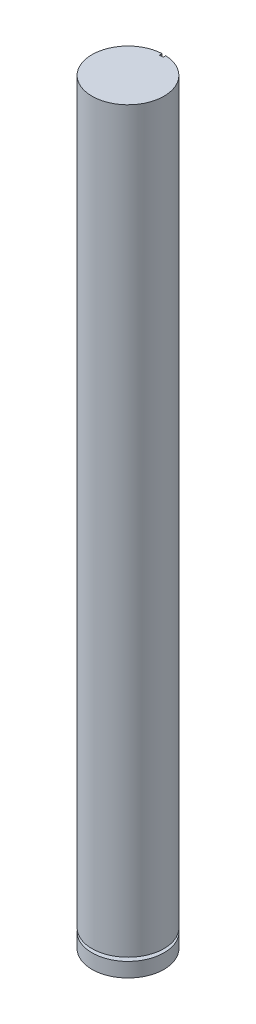
ISO-10303-21;
HEADER;
FILE_DESCRIPTION(('STEP AP214'),'2;1');
FILE_NAME('part.step','',(''),(''),'','','');
FILE_SCHEMA(('AUTOMOTIVE_DESIGN { 1 0 10303 214 1 1 1 1 }'));
ENDSEC;
DATA;
#1=APPLICATION_CONTEXT('core data for automotive mechanical design processes');
#2=APPLICATION_PROTOCOL_DEFINITION('international standard','automotive_design',2000,#1);
#3=PRODUCT_CONTEXT('',#1,'mechanical');
#4=PRODUCT('Part','Part','',(#3));
#5=PRODUCT_RELATED_PRODUCT_CATEGORY('part','',(#4));
#6=PRODUCT_DEFINITION_FORMATION('','',#4);
#7=PRODUCT_DEFINITION_CONTEXT('part definition',#1,'design');
#8=PRODUCT_DEFINITION('design','',#6,#7);
#9=PRODUCT_DEFINITION_SHAPE('','',#8);
#10=(LENGTH_UNIT() NAMED_UNIT(*) SI_UNIT(.MILLI.,.METRE.));
#11=(NAMED_UNIT(*) PLANE_ANGLE_UNIT() SI_UNIT($,.RADIAN.));
#12=(NAMED_UNIT(*) SI_UNIT($,.STERADIAN.) SOLID_ANGLE_UNIT());
#13=UNCERTAINTY_MEASURE_WITH_UNIT(LENGTH_MEASURE(1.E-05),#10,'distance_accuracy_value','');
#14=(GEOMETRIC_REPRESENTATION_CONTEXT(3) GLOBAL_UNCERTAINTY_ASSIGNED_CONTEXT((#13)) GLOBAL_UNIT_ASSIGNED_CONTEXT((#10,
#11,#12)) REPRESENTATION_CONTEXT('',''));
#15=CARTESIAN_POINT('',(0.,0.,0.));
#16=DIRECTION('',(0.,0.,1.));
#17=DIRECTION('',(1.,0.,0.));
#18=AXIS2_PLACEMENT_3D('',#15,#16,#17);
#19=CARTESIAN_POINT('',(0.,420.,0.));
#20=DIRECTION('',(0.,-1.,0.));
#21=DIRECTION('',(0.,0.,-1.));
#22=AXIS2_PLACEMENT_3D('',#19,#20,#21);
#23=CYLINDRICAL_SURFACE('',#22,20.);
#24=CARTESIAN_POINT('',(0.,10.,0.));
#25=DIRECTION('',(0.,-1.,0.));
#26=DIRECTION('',(0.,0.,-1.));
#27=AXIS2_PLACEMENT_3D('',#24,#25,#26);
#28=CIRCLE('',#27,20.);
#29=CARTESIAN_POINT('',(0.,10.,-20.));
#30=VERTEX_POINT('',#29);
#31=EDGE_CURVE('E125',#30,#30,#28,.T.);
#32=ORIENTED_EDGE('',*,*,#31,.F.);
#33=EDGE_LOOP('',(#32));
#34=FACE_BOUND('',#33,.T.);
#35=DIRECTION('',(0.,-1.,0.));
#36=VECTOR('',#35,1.);
#37=CARTESIAN_POINT('',(1.,420.,-19.9749843554382));
#38=LINE('',#37,#36);
#39=CARTESIAN_POINT('',(1.,420.,-19.9749843554382));
#40=VERTEX_POINT('',#39);
#41=CARTESIAN_POINT('',(1.,390.,-19.9749843554382));
#42=VERTEX_POINT('',#41);
#43=EDGE_CURVE('E86',#40,#42,#38,.T.);
#44=ORIENTED_EDGE('',*,*,#43,.F.);
#45=CARTESIAN_POINT('',(0.,420.,0.));
#46=DIRECTION('',(0.,1.,0.));
#47=DIRECTION('',(0.,0.,1.));
#48=AXIS2_PLACEMENT_3D('',#45,#46,#47);
#49=CIRCLE('',#48,20.);
#50=CARTESIAN_POINT('',(-1.,420.,-19.9749843554382));
#51=VERTEX_POINT('',#50);
#52=EDGE_CURVE('E130',#51,#40,#49,.T.);
#53=ORIENTED_EDGE('',*,*,#52,.F.);
#54=DIRECTION('',(0.,-1.,0.));
#55=VECTOR('',#54,1.);
#56=CARTESIAN_POINT('',(-1.,420.,-19.9749843554382));
#57=LINE('',#56,#55);
#58=CARTESIAN_POINT('',(-1.,390.,-19.9749843554382));
#59=VERTEX_POINT('',#58);
#60=EDGE_CURVE('E55',#51,#59,#57,.T.);
#61=ORIENTED_EDGE('',*,*,#60,.T.);
#62=CARTESIAN_POINT('',(0.,390.,0.));
#63=DIRECTION('',(0.,-1.,0.));
#64=DIRECTION('',(0.,0.,-1.));
#65=AXIS2_PLACEMENT_3D('',#62,#63,#64);
#66=CIRCLE('',#65,20.);
#67=EDGE_CURVE('E11',#59,#42,#66,.T.);
#68=ORIENTED_EDGE('',*,*,#67,.T.);
#69=EDGE_LOOP('',(#44,#53,#61,#68));
#70=FACE_BOUND('',#69,.T.);
#71=ADVANCED_FACE('F39',(#34,#70),#23,.T.);
#72=CARTESIAN_POINT('',(0.,420.,0.));
#73=DIRECTION('',(0.,1.,0.));
#74=DIRECTION('',(0.,0.,1.));
#75=AXIS2_PLACEMENT_3D('',#72,#73,#74);
#76=PLANE('',#75);
#77=ORIENTED_EDGE('',*,*,#52,.T.);
#78=DIRECTION('',(0.,0.,1.));
#79=VECTOR('',#78,1.);
#80=CARTESIAN_POINT('',(1.,420.,0.));
#81=LINE('',#80,#79);
#82=CARTESIAN_POINT('',(1.,420.,-18.5));
#83=VERTEX_POINT('',#82);
#84=EDGE_CURVE('E48',#40,#83,#81,.T.);
#85=ORIENTED_EDGE('',*,*,#84,.T.);
#86=DIRECTION('',(-1.,0.,0.));
#87=VECTOR('',#86,1.);
#88=CARTESIAN_POINT('',(1.,420.,-18.5));
#89=LINE('',#88,#87);
#90=CARTESIAN_POINT('',(-1.,420.,-18.5));
#91=VERTEX_POINT('',#90);
#92=EDGE_CURVE('E90',#83,#91,#89,.T.);
#93=ORIENTED_EDGE('',*,*,#92,.T.);
#94=DIRECTION('',(0.,0.,1.));
#95=VECTOR('',#94,1.);
#96=CARTESIAN_POINT('',(-1.,420.,0.));
#97=LINE('',#96,#95);
#98=EDGE_CURVE('E134',#51,#91,#97,.T.);
#99=ORIENTED_EDGE('',*,*,#98,.F.);
#100=EDGE_LOOP('',(#77,#85,#93,#99));
#101=FACE_BOUND('',#100,.T.);
#102=ADVANCED_FACE('F141',(#101),#76,.T.);
#103=CARTESIAN_POINT('',(0.,10.,-20.));
#104=DIRECTION('',(0.,1.,0.));
#105=DIRECTION('',(0.,0.,1.));
#106=AXIS2_PLACEMENT_3D('',#103,#104,#105);
#107=PLANE('',#106);
#108=CARTESIAN_POINT('',(0.,10.,0.));
#109=DIRECTION('',(0.,-1.,0.));
#110=DIRECTION('',(0.,0.,-1.));
#111=AXIS2_PLACEMENT_3D('',#108,#109,#110);
#112=CIRCLE('',#111,15.);
#113=CARTESIAN_POINT('',(0.,10.,-15.));
#114=VERTEX_POINT('',#113);
#115=EDGE_CURVE('E121',#114,#114,#112,.T.);
#116=ORIENTED_EDGE('',*,*,#115,.F.);
#117=EDGE_LOOP('',(#116));
#118=FACE_BOUND('',#117,.T.);
#119=ORIENTED_EDGE('',*,*,#31,.T.);
#120=EDGE_LOOP('',(#119));
#121=FACE_BOUND('',#120,.T.);
#122=ADVANCED_FACE('F148',(#118,#121),#107,.F.);
#123=CARTESIAN_POINT('',(0.,0.,0.));
#124=DIRECTION('',(0.,-1.,0.));
#125=DIRECTION('',(0.,0.,-1.));
#126=AXIS2_PLACEMENT_3D('',#123,#124,#125);
#127=CYLINDRICAL_SURFACE('',#126,15.);
#128=CARTESIAN_POINT('',(0.,8.,0.));
#129=DIRECTION('',(0.,-1.,0.));
#130=DIRECTION('',(0.,0.,-1.));
#131=AXIS2_PLACEMENT_3D('',#128,#129,#130);
#132=CIRCLE('',#131,15.);
#133=CARTESIAN_POINT('',(0.,8.,-15.));
#134=VERTEX_POINT('',#133);
#135=EDGE_CURVE('E117',#134,#134,#132,.T.);
#136=ORIENTED_EDGE('',*,*,#135,.F.);
#137=EDGE_LOOP('',(#136));
#138=FACE_BOUND('',#137,.T.);
#139=ORIENTED_EDGE('',*,*,#115,.T.);
#140=EDGE_LOOP('',(#139));
#141=FACE_BOUND('',#140,.T.);
#142=ADVANCED_FACE('F167',(#138,#141),#127,.T.);
#143=CARTESIAN_POINT('',(0.,8.,-15.));
#144=DIRECTION('',(0.,-1.,0.));
#145=DIRECTION('',(0.,0.,-1.));
#146=AXIS2_PLACEMENT_3D('',#143,#144,#145);
#147=PLANE('',#146);
#148=CARTESIAN_POINT('',(0.,8.,0.));
#149=DIRECTION('',(0.,-1.,0.));
#150=DIRECTION('',(0.,0.,-1.));
#151=AXIS2_PLACEMENT_3D('',#148,#149,#150);
#152=CIRCLE('',#151,20.);
#153=CARTESIAN_POINT('',(0.,8.,-20.));
#154=VERTEX_POINT('',#153);
#155=EDGE_CURVE('E113',#154,#154,#152,.T.);
#156=ORIENTED_EDGE('',*,*,#155,.F.);
#157=EDGE_LOOP('',(#156));
#158=FACE_BOUND('',#157,.T.);
#159=ORIENTED_EDGE('',*,*,#135,.T.);
#160=EDGE_LOOP('',(#159));
#161=FACE_BOUND('',#160,.T.);
#162=ADVANCED_FACE('F159',(#158,#161),#147,.F.);
#163=CARTESIAN_POINT('',(0.,0.,0.));
#164=DIRECTION('',(0.,1.,0.));
#165=DIRECTION('',(0.,0.,1.));
#166=AXIS2_PLACEMENT_3D('',#163,#164,#165);
#167=PLANE('',#166);
#168=CARTESIAN_POINT('',(0.,0.,0.));
#169=DIRECTION('',(0.,1.,0.));
#170=DIRECTION('',(0.,0.,1.));
#171=AXIS2_PLACEMENT_3D('',#168,#169,#170);
#172=CIRCLE('',#171,20.);
#173=CARTESIAN_POINT('',(0.,0.,20.));
#174=VERTEX_POINT('',#173);
#175=EDGE_CURVE('E129',#174,#174,#172,.T.);
#176=ORIENTED_EDGE('',*,*,#175,.F.);
#177=EDGE_LOOP('',(#176));
#178=FACE_BOUND('',#177,.T.);
#179=ADVANCED_FACE('F152',(#178),#167,.F.);
#180=ORIENTED_EDGE('',*,*,#155,.T.);
#181=EDGE_LOOP('',(#180));
#182=FACE_BOUND('',#181,.T.);
#183=ORIENTED_EDGE('',*,*,#175,.T.);
#184=EDGE_LOOP('',(#183));
#185=FACE_BOUND('',#184,.T.);
#186=ADVANCED_FACE('F41',(#182,#185),#23,.T.);
#187=CARTESIAN_POINT('',(0.,390.,0.));
#188=DIRECTION('',(0.,-1.,0.));
#189=DIRECTION('',(0.,0.,-1.));
#190=AXIS2_PLACEMENT_3D('',#187,#188,#189);
#191=PLANE('',#190);
#192=ORIENTED_EDGE('',*,*,#67,.F.);
#193=DIRECTION('',(0.,0.,1.));
#194=VECTOR('',#193,1.);
#195=CARTESIAN_POINT('',(-1.,390.,-20.));
#196=LINE('',#195,#194);
#197=CARTESIAN_POINT('',(-1.,390.,-18.5));
#198=VERTEX_POINT('',#197);
#199=EDGE_CURVE('E94',#59,#198,#196,.T.);
#200=ORIENTED_EDGE('',*,*,#199,.T.);
#201=DIRECTION('',(-1.,0.,0.));
#202=VECTOR('',#201,1.);
#203=CARTESIAN_POINT('',(1.,390.,-18.5));
#204=LINE('',#203,#202);
#205=CARTESIAN_POINT('',(1.,390.,-18.5));
#206=VERTEX_POINT('',#205);
#207=EDGE_CURVE('E89',#206,#198,#204,.T.);
#208=ORIENTED_EDGE('',*,*,#207,.F.);
#209=DIRECTION('',(0.,0.,1.));
#210=VECTOR('',#209,1.);
#211=CARTESIAN_POINT('',(1.,390.,-20.));
#212=LINE('',#211,#210);
#213=EDGE_CURVE('E80',#42,#206,#212,.T.);
#214=ORIENTED_EDGE('',*,*,#213,.F.);
#215=EDGE_LOOP('',(#192,#200,#208,#214));
#216=FACE_BOUND('',#215,.T.);
#217=ADVANCED_FACE('F93',(#216),#191,.F.);
#218=CARTESIAN_POINT('',(1.,390.,-20.));
#219=DIRECTION('',(-1.,0.,0.));
#220=DIRECTION('',(0.,0.,1.));
#221=AXIS2_PLACEMENT_3D('',#218,#219,#220);
#222=PLANE('',#221);
#223=ORIENTED_EDGE('',*,*,#43,.T.);
#224=ORIENTED_EDGE('',*,*,#213,.T.);
#225=DIRECTION('',(0.,1.,0.));
#226=VECTOR('',#225,1.);
#227=CARTESIAN_POINT('',(1.,390.,-18.5));
#228=LINE('',#227,#226);
#229=EDGE_CURVE('E84',#206,#83,#228,.T.);
#230=ORIENTED_EDGE('',*,*,#229,.T.);
#231=ORIENTED_EDGE('',*,*,#84,.F.);
#232=EDGE_LOOP('',(#223,#224,#230,#231));
#233=FACE_BOUND('',#232,.T.);
#234=ADVANCED_FACE('F82',(#233),#222,.T.);
#235=CARTESIAN_POINT('',(-1.,390.,-20.));
#236=DIRECTION('',(-1.,0.,0.));
#237=DIRECTION('',(0.,0.,1.));
#238=AXIS2_PLACEMENT_3D('',#235,#236,#237);
#239=PLANE('',#238);
#240=ORIENTED_EDGE('',*,*,#98,.T.);
#241=DIRECTION('',(0.,1.,0.));
#242=VECTOR('',#241,1.);
#243=CARTESIAN_POINT('',(-1.,390.,-18.5));
#244=LINE('',#243,#242);
#245=EDGE_CURVE('E103',#198,#91,#244,.T.);
#246=ORIENTED_EDGE('',*,*,#245,.F.);
#247=ORIENTED_EDGE('',*,*,#199,.F.);
#248=ORIENTED_EDGE('',*,*,#60,.F.);
#249=EDGE_LOOP('',(#240,#246,#247,#248));
#250=FACE_BOUND('',#249,.T.);
#251=ADVANCED_FACE('F184',(#250),#239,.F.);
#252=CARTESIAN_POINT('',(1.,390.,-18.5));
#253=DIRECTION('',(0.,0.,-1.));
#254=DIRECTION('',(-1.,0.,0.));
#255=AXIS2_PLACEMENT_3D('',#252,#253,#254);
#256=PLANE('',#255);
#257=ORIENTED_EDGE('',*,*,#92,.F.);
#258=ORIENTED_EDGE('',*,*,#229,.F.);
#259=ORIENTED_EDGE('',*,*,#207,.T.);
#260=ORIENTED_EDGE('',*,*,#245,.T.);
#261=EDGE_LOOP('',(#257,#258,#259,#260));
#262=FACE_BOUND('',#261,.T.);
#263=ADVANCED_FACE('F100',(#262),#256,.T.);
#264=CLOSED_SHELL('',(#71,#102,#122,#142,#162,#179,#186,#217,#234,#251,#263));
#265=MANIFOLD_SOLID_BREP('B2',#264);
#266=ADVANCED_BREP_SHAPE_REPRESENTATION('',(#18,#265),#14);
#267=SHAPE_DEFINITION_REPRESENTATION(#9,#266);
ENDSEC;
END-ISO-10303-21;
